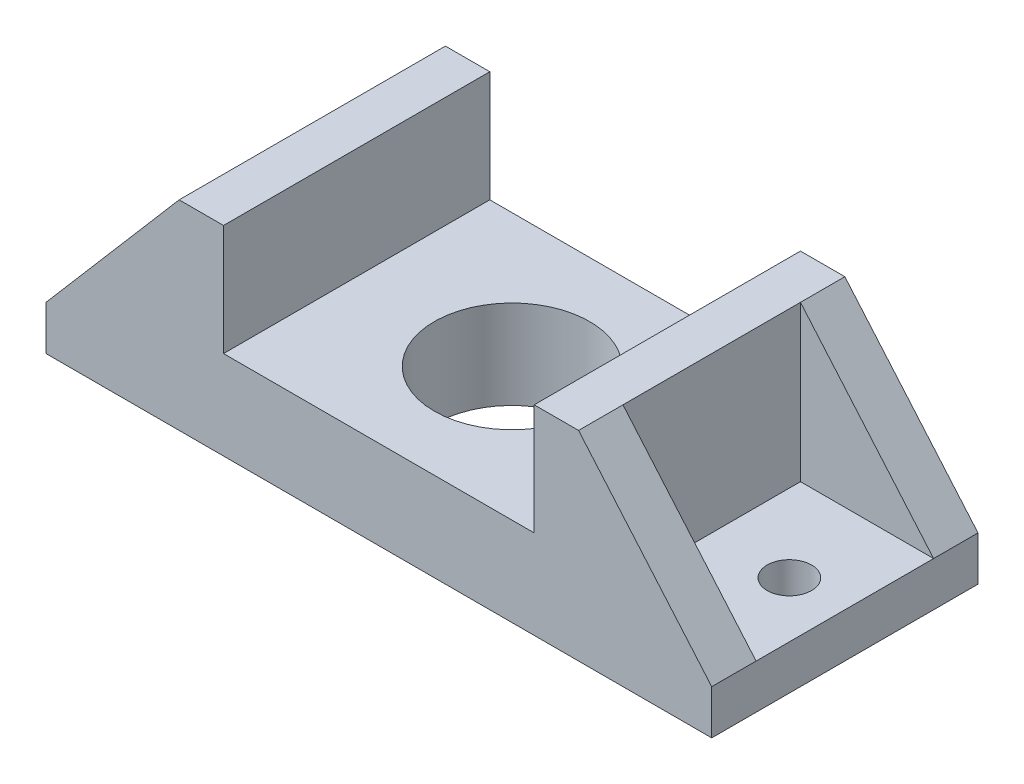
ISO-10303-21;
HEADER;
FILE_DESCRIPTION(('STEP AP214'),'2;1');
FILE_NAME('part.step','',(''),(''),'','','');
FILE_SCHEMA(('AUTOMOTIVE_DESIGN { 1 0 10303 214 1 1 1 1 }'));
ENDSEC;
DATA;
#1=APPLICATION_CONTEXT('core data for automotive mechanical design processes');
#2=APPLICATION_PROTOCOL_DEFINITION('international standard','automotive_design',2000,#1);
#3=PRODUCT_CONTEXT('',#1,'mechanical');
#4=PRODUCT('Part','Part','',(#3));
#5=PRODUCT_RELATED_PRODUCT_CATEGORY('part','',(#4));
#6=PRODUCT_DEFINITION_FORMATION('','',#4);
#7=PRODUCT_DEFINITION_CONTEXT('part definition',#1,'design');
#8=PRODUCT_DEFINITION('design','',#6,#7);
#9=PRODUCT_DEFINITION_SHAPE('','',#8);
#10=(LENGTH_UNIT() NAMED_UNIT(*) SI_UNIT(.MILLI.,.METRE.));
#11=(NAMED_UNIT(*) PLANE_ANGLE_UNIT() SI_UNIT($,.RADIAN.));
#12=(NAMED_UNIT(*) SI_UNIT($,.STERADIAN.) SOLID_ANGLE_UNIT());
#13=UNCERTAINTY_MEASURE_WITH_UNIT(LENGTH_MEASURE(1.E-05),#10,'distance_accuracy_value','');
#14=(GEOMETRIC_REPRESENTATION_CONTEXT(3) GLOBAL_UNCERTAINTY_ASSIGNED_CONTEXT((#13)) GLOBAL_UNIT_ASSIGNED_CONTEXT((#10,
#11,#12)) REPRESENTATION_CONTEXT('',''));
#15=CARTESIAN_POINT('',(0.,0.,0.));
#16=DIRECTION('',(0.,0.,1.));
#17=DIRECTION('',(1.,0.,0.));
#18=AXIS2_PLACEMENT_3D('',#15,#16,#17);
#19=CARTESIAN_POINT('',(0.,20.,0.));
#20=DIRECTION('',(0.,-1.,0.));
#21=DIRECTION('',(0.,0.,-1.));
#22=AXIS2_PLACEMENT_3D('',#19,#20,#21);
#23=PLANE('',#22);
#24=CARTESIAN_POINT('',(275.,20.,-60.));
#25=DIRECTION('',(0.,1.,0.));
#26=DIRECTION('',(0.,0.,-1.));
#27=AXIS2_PLACEMENT_3D('',#24,#25,#26);
#28=CIRCLE('',#27,10.);
#29=CARTESIAN_POINT('',(275.,20.,-70.));
#30=VERTEX_POINT('',#29);
#31=EDGE_CURVE('E373',#30,#30,#28,.T.);
#32=ORIENTED_EDGE('',*,*,#31,.F.);
#33=EDGE_LOOP('',(#32));
#34=FACE_BOUND('',#33,.T.);
#35=DIRECTION('',(-1.,0.,0.));
#36=VECTOR('',#35,1.);
#37=CARTESIAN_POINT('',(240.,20.,-20.));
#38=LINE('',#37,#36);
#39=CARTESIAN_POINT('',(300.,20.,-20.));
#40=VERTEX_POINT('',#39);
#41=CARTESIAN_POINT('',(240.,20.,-20.));
#42=VERTEX_POINT('',#41);
#43=EDGE_CURVE('E59',#40,#42,#38,.T.);
#44=ORIENTED_EDGE('',*,*,#43,.F.);
#45=DIRECTION('',(0.,0.,-1.));
#46=VECTOR('',#45,1.);
#47=CARTESIAN_POINT('',(300.,20.,0.));
#48=LINE('',#47,#46);
#49=CARTESIAN_POINT('',(300.,20.,-100.));
#50=VERTEX_POINT('',#49);
#51=EDGE_CURVE('E270',#40,#50,#48,.T.);
#52=ORIENTED_EDGE('',*,*,#51,.T.);
#53=DIRECTION('',(-1.,0.,0.));
#54=VECTOR('',#53,1.);
#55=CARTESIAN_POINT('',(240.,20.,-100.));
#56=LINE('',#55,#54);
#57=CARTESIAN_POINT('',(240.,20.,-100.));
#58=VERTEX_POINT('',#57);
#59=EDGE_CURVE('E184',#50,#58,#56,.T.);
#60=ORIENTED_EDGE('',*,*,#59,.T.);
#61=DIRECTION('',(0.,0.,1.));
#62=VECTOR('',#61,1.);
#63=CARTESIAN_POINT('',(240.,20.,-120.));
#64=LINE('',#63,#62);
#65=EDGE_CURVE('E235',#58,#42,#64,.T.);
#66=ORIENTED_EDGE('',*,*,#65,.T.);
#67=EDGE_LOOP('',(#44,#52,#60,#66));
#68=FACE_BOUND('',#67,.T.);
#69=ADVANCED_FACE('F36',(#34,#68),#23,.F.);
#70=CARTESIAN_POINT('',(240.,90.,-120.));
#71=DIRECTION('',(1.,0.,0.));
#72=DIRECTION('',(0.,0.,-1.));
#73=AXIS2_PLACEMENT_3D('',#70,#71,#72);
#74=PLANE('',#73);
#75=DIRECTION('',(0.,0.,1.));
#76=VECTOR('',#75,1.);
#77=CARTESIAN_POINT('',(240.,90.,-120.));
#78=LINE('',#77,#76);
#79=CARTESIAN_POINT('',(240.,90.,-100.));
#80=VERTEX_POINT('',#79);
#81=CARTESIAN_POINT('',(240.,90.,-20.));
#82=VERTEX_POINT('',#81);
#83=EDGE_CURVE('E240',#80,#82,#78,.T.);
#84=ORIENTED_EDGE('',*,*,#83,.T.);
#85=DIRECTION('',(0.,1.,0.));
#86=VECTOR('',#85,1.);
#87=CARTESIAN_POINT('',(240.,90.,-20.));
#88=LINE('',#87,#86);
#89=EDGE_CURVE('E52',#42,#82,#88,.T.);
#90=ORIENTED_EDGE('',*,*,#89,.F.);
#91=ORIENTED_EDGE('',*,*,#65,.F.);
#92=DIRECTION('',(0.,1.,0.));
#93=VECTOR('',#92,1.);
#94=CARTESIAN_POINT('',(240.,90.,-100.));
#95=LINE('',#94,#93);
#96=EDGE_CURVE('E186',#58,#80,#95,.T.);
#97=ORIENTED_EDGE('',*,*,#96,.T.);
#98=EDGE_LOOP('',(#84,#90,#91,#97));
#99=FACE_BOUND('',#98,.T.);
#100=ADVANCED_FACE('F348',(#99),#74,.T.);
#101=CARTESIAN_POINT('',(25.,20.,-60.));
#102=DIRECTION('',(0.,1.,0.));
#103=DIRECTION('',(0.,0.,1.));
#104=AXIS2_PLACEMENT_3D('',#101,#102,#103);
#105=CIRCLE('',#104,10.);
#106=CARTESIAN_POINT('',(25.,20.,-50.));
#107=VERTEX_POINT('',#106);
#108=EDGE_CURVE('E365',#107,#107,#105,.T.);
#109=ORIENTED_EDGE('',*,*,#108,.F.);
#110=EDGE_LOOP('',(#109));
#111=FACE_BOUND('',#110,.T.);
#112=DIRECTION('',(1.,0.,0.));
#113=VECTOR('',#112,1.);
#114=CARTESIAN_POINT('',(60.,20.,-100.));
#115=LINE('',#114,#113);
#116=CARTESIAN_POINT('',(0.,20.,-100.));
#117=VERTEX_POINT('',#116);
#118=CARTESIAN_POINT('',(60.,20.,-100.));
#119=VERTEX_POINT('',#118);
#120=EDGE_CURVE('E198',#117,#119,#115,.T.);
#121=ORIENTED_EDGE('',*,*,#120,.F.);
#122=DIRECTION('',(0.,0.,1.));
#123=VECTOR('',#122,1.);
#124=CARTESIAN_POINT('',(0.,20.,0.));
#125=LINE('',#124,#123);
#126=CARTESIAN_POINT('',(0.,20.,-20.));
#127=VERTEX_POINT('',#126);
#128=EDGE_CURVE('E271',#117,#127,#125,.T.);
#129=ORIENTED_EDGE('',*,*,#128,.T.);
#130=DIRECTION('',(1.,0.,0.));
#131=VECTOR('',#130,1.);
#132=CARTESIAN_POINT('',(60.,20.,-20.));
#133=LINE('',#132,#131);
#134=CARTESIAN_POINT('',(60.,20.,-20.));
#135=VERTEX_POINT('',#134);
#136=EDGE_CURVE('E207',#127,#135,#133,.T.);
#137=ORIENTED_EDGE('',*,*,#136,.T.);
#138=DIRECTION('',(0.,0.,1.));
#139=VECTOR('',#138,1.);
#140=CARTESIAN_POINT('',(60.,20.,-120.));
#141=LINE('',#140,#139);
#142=EDGE_CURVE('E248',#119,#135,#141,.T.);
#143=ORIENTED_EDGE('',*,*,#142,.F.);
#144=EDGE_LOOP('',(#121,#129,#137,#143));
#145=FACE_BOUND('',#144,.T.);
#146=ADVANCED_FACE('F309',(#111,#145),#23,.F.);
#147=CARTESIAN_POINT('',(60.,90.,-120.));
#148=DIRECTION('',(1.,0.,0.));
#149=DIRECTION('',(0.,0.,-1.));
#150=AXIS2_PLACEMENT_3D('',#147,#148,#149);
#151=PLANE('',#150);
#152=DIRECTION('',(0.,1.,0.));
#153=VECTOR('',#152,1.);
#154=CARTESIAN_POINT('',(60.,90.,-100.));
#155=LINE('',#154,#153);
#156=CARTESIAN_POINT('',(60.,90.,-100.));
#157=VERTEX_POINT('',#156);
#158=EDGE_CURVE('E202',#119,#157,#155,.T.);
#159=ORIENTED_EDGE('',*,*,#158,.F.);
#160=ORIENTED_EDGE('',*,*,#142,.T.);
#161=DIRECTION('',(0.,1.,0.));
#162=VECTOR('',#161,1.);
#163=CARTESIAN_POINT('',(60.,90.,-20.));
#164=LINE('',#163,#162);
#165=CARTESIAN_POINT('',(60.,90.,-20.));
#166=VERTEX_POINT('',#165);
#167=EDGE_CURVE('E210',#135,#166,#164,.T.);
#168=ORIENTED_EDGE('',*,*,#167,.T.);
#169=DIRECTION('',(0.,0.,1.));
#170=VECTOR('',#169,1.);
#171=CARTESIAN_POINT('',(60.,90.,-120.));
#172=LINE('',#171,#170);
#173=EDGE_CURVE('E253',#157,#166,#172,.T.);
#174=ORIENTED_EDGE('',*,*,#173,.F.);
#175=EDGE_LOOP('',(#159,#160,#168,#174));
#176=FACE_BOUND('',#175,.T.);
#177=ADVANCED_FACE('F316',(#176),#151,.F.);
#178=CARTESIAN_POINT('',(0.,20.,0.));
#179=DIRECTION('',(1.,0.,0.));
#180=DIRECTION('',(0.,0.,-1.));
#181=AXIS2_PLACEMENT_3D('',#178,#179,#180);
#182=PLANE('',#181);
#183=DIRECTION('',(0.,0.,1.));
#184=VECTOR('',#183,1.);
#185=CARTESIAN_POINT('',(0.,0.,0.));
#186=LINE('',#185,#184);
#187=CARTESIAN_POINT('',(0.,0.,-120.));
#188=VERTEX_POINT('',#187);
#189=CARTESIAN_POINT('',(0.,0.,0.));
#190=VERTEX_POINT('',#189);
#191=EDGE_CURVE('E266',#188,#190,#186,.T.);
#192=ORIENTED_EDGE('',*,*,#191,.T.);
#193=DIRECTION('',(0.,-1.,0.));
#194=VECTOR('',#193,1.);
#195=CARTESIAN_POINT('',(0.,20.,0.));
#196=LINE('',#195,#194);
#197=CARTESIAN_POINT('',(0.,20.,0.));
#198=VERTEX_POINT('',#197);
#199=EDGE_CURVE('E11',#198,#190,#196,.T.);
#200=ORIENTED_EDGE('',*,*,#199,.F.);
#201=DIRECTION('',(0.,0.,1.));
#202=VECTOR('',#201,1.);
#203=CARTESIAN_POINT('',(0.,20.,-20.));
#204=LINE('',#203,#202);
#205=EDGE_CURVE('E219',#127,#198,#204,.T.);
#206=ORIENTED_EDGE('',*,*,#205,.F.);
#207=ORIENTED_EDGE('',*,*,#128,.F.);
#208=CARTESIAN_POINT('',(0.,20.,-120.));
#209=VERTEX_POINT('',#208);
#210=EDGE_CURVE('E267',#209,#117,#125,.T.);
#211=ORIENTED_EDGE('',*,*,#210,.F.);
#212=DIRECTION('',(0.,-1.,0.));
#213=VECTOR('',#212,1.);
#214=CARTESIAN_POINT('',(0.,20.,-120.));
#215=LINE('',#214,#213);
#216=EDGE_CURVE('E274',#209,#188,#215,.T.);
#217=ORIENTED_EDGE('',*,*,#216,.T.);
#218=EDGE_LOOP('',(#192,#200,#206,#207,#211,#217));
#219=FACE_BOUND('',#218,.T.);
#220=ADVANCED_FACE('F38',(#219),#182,.F.);
#221=CARTESIAN_POINT('',(0.,20.,0.));
#222=DIRECTION('',(0.,0.,-1.));
#223=DIRECTION('',(-1.,0.,0.));
#224=AXIS2_PLACEMENT_3D('',#221,#222,#223);
#225=PLANE('',#224);
#226=DIRECTION('',(0.,-1.,0.));
#227=VECTOR('',#226,1.);
#228=CARTESIAN_POINT('',(300.,20.,0.));
#229=LINE('',#228,#227);
#230=CARTESIAN_POINT('',(300.,20.,0.));
#231=VERTEX_POINT('',#230);
#232=CARTESIAN_POINT('',(300.,0.,0.));
#233=VERTEX_POINT('',#232);
#234=EDGE_CURVE('E45',#231,#233,#229,.T.);
#235=ORIENTED_EDGE('',*,*,#234,.F.);
#236=DIRECTION('',(0.650791373455968,-0.759256602365297,0.));
#237=VECTOR('',#236,1.);
#238=CARTESIAN_POINT('',(300.,20.,0.));
#239=LINE('',#238,#237);
#240=CARTESIAN_POINT('',(240.,90.,0.));
#241=VERTEX_POINT('',#240);
#242=EDGE_CURVE('E169',#241,#231,#239,.T.);
#243=ORIENTED_EDGE('',*,*,#242,.F.);
#244=DIRECTION('',(-1.,0.,0.));
#245=VECTOR('',#244,1.);
#246=CARTESIAN_POINT('',(240.,90.,0.));
#247=LINE('',#246,#245);
#248=CARTESIAN_POINT('',(220.,90.,0.));
#249=VERTEX_POINT('',#248);
#250=EDGE_CURVE('E152',#241,#249,#247,.T.);
#251=ORIENTED_EDGE('',*,*,#250,.T.);
#252=DIRECTION('',(0.,-1.,0.));
#253=VECTOR('',#252,1.);
#254=CARTESIAN_POINT('',(220.,90.,0.));
#255=LINE('',#254,#253);
#256=CARTESIAN_POINT('',(220.,40.,0.));
#257=VERTEX_POINT('',#256);
#258=EDGE_CURVE('E162',#249,#257,#255,.T.);
#259=ORIENTED_EDGE('',*,*,#258,.T.);
#260=DIRECTION('',(1.,0.,0.));
#261=VECTOR('',#260,1.);
#262=CARTESIAN_POINT('',(80.,40.,0.));
#263=LINE('',#262,#261);
#264=CARTESIAN_POINT('',(80.,40.,0.));
#265=VERTEX_POINT('',#264);
#266=EDGE_CURVE('E226',#265,#257,#263,.T.);
#267=ORIENTED_EDGE('',*,*,#266,.F.);
#268=DIRECTION('',(0.,-1.,0.));
#269=VECTOR('',#268,1.);
#270=CARTESIAN_POINT('',(80.,90.,0.));
#271=LINE('',#270,#269);
#272=CARTESIAN_POINT('',(80.,90.,0.));
#273=VERTEX_POINT('',#272);
#274=EDGE_CURVE('E264',#273,#265,#271,.T.);
#275=ORIENTED_EDGE('',*,*,#274,.F.);
#276=DIRECTION('',(1.,0.,0.));
#277=VECTOR('',#276,1.);
#278=CARTESIAN_POINT('',(60.,90.,0.));
#279=LINE('',#278,#277);
#280=CARTESIAN_POINT('',(60.,90.,0.));
#281=VERTEX_POINT('',#280);
#282=EDGE_CURVE('E252',#281,#273,#279,.T.);
#283=ORIENTED_EDGE('',*,*,#282,.F.);
#284=DIRECTION('',(-0.650791373455968,-0.759256602365297,0.));
#285=VECTOR('',#284,1.);
#286=CARTESIAN_POINT('',(0.,20.,0.));
#287=LINE('',#286,#285);
#288=EDGE_CURVE('E205',#281,#198,#287,.T.);
#289=ORIENTED_EDGE('',*,*,#288,.T.);
#290=ORIENTED_EDGE('',*,*,#199,.T.);
#291=DIRECTION('',(1.,0.,0.));
#292=VECTOR('',#291,1.);
#293=CARTESIAN_POINT('',(0.,0.,0.));
#294=LINE('',#293,#292);
#295=EDGE_CURVE('E277',#190,#233,#294,.T.);
#296=ORIENTED_EDGE('',*,*,#295,.T.);
#297=EDGE_LOOP('',(#235,#243,#251,#259,#267,#275,#283,#289,#290,#296));
#298=FACE_BOUND('',#297,.T.);
#299=ADVANCED_FACE('F174',(#298),#225,.F.);
#300=CARTESIAN_POINT('',(300.,20.,0.));
#301=DIRECTION('',(-1.,0.,0.));
#302=DIRECTION('',(0.,0.,1.));
#303=AXIS2_PLACEMENT_3D('',#300,#301,#302);
#304=PLANE('',#303);
#305=DIRECTION('',(0.,0.,-1.));
#306=VECTOR('',#305,1.);
#307=CARTESIAN_POINT('',(300.,0.,0.));
#308=LINE('',#307,#306);
#309=CARTESIAN_POINT('',(300.,0.,-120.));
#310=VERTEX_POINT('',#309);
#311=EDGE_CURVE('E279',#233,#310,#308,.T.);
#312=ORIENTED_EDGE('',*,*,#311,.T.);
#313=DIRECTION('',(0.,-1.,0.));
#314=VECTOR('',#313,1.);
#315=CARTESIAN_POINT('',(300.,20.,-120.));
#316=LINE('',#315,#314);
#317=CARTESIAN_POINT('',(300.,20.,-120.));
#318=VERTEX_POINT('',#317);
#319=EDGE_CURVE('E285',#318,#310,#316,.T.);
#320=ORIENTED_EDGE('',*,*,#319,.F.);
#321=DIRECTION('',(0.,0.,-1.));
#322=VECTOR('',#321,1.);
#323=CARTESIAN_POINT('',(300.,20.,-100.));
#324=LINE('',#323,#322);
#325=EDGE_CURVE('E192',#50,#318,#324,.T.);
#326=ORIENTED_EDGE('',*,*,#325,.F.);
#327=ORIENTED_EDGE('',*,*,#51,.F.);
#328=EDGE_CURVE('E272',#231,#40,#48,.T.);
#329=ORIENTED_EDGE('',*,*,#328,.F.);
#330=ORIENTED_EDGE('',*,*,#234,.T.);
#331=EDGE_LOOP('',(#312,#320,#326,#327,#329,#330));
#332=FACE_BOUND('',#331,.T.);
#333=ADVANCED_FACE('F290',(#332),#304,.F.);
#334=CARTESIAN_POINT('',(0.,20.,-120.));
#335=DIRECTION('',(0.,0.,1.));
#336=DIRECTION('',(1.,0.,0.));
#337=AXIS2_PLACEMENT_3D('',#334,#335,#336);
#338=PLANE('',#337);
#339=ORIENTED_EDGE('',*,*,#216,.F.);
#340=DIRECTION('',(-0.650791373455968,-0.759256602365297,0.));
#341=VECTOR('',#340,1.);
#342=CARTESIAN_POINT('',(0.,20.,-120.));
#343=LINE('',#342,#341);
#344=CARTESIAN_POINT('',(60.,90.,-120.));
#345=VERTEX_POINT('',#344);
#346=EDGE_CURVE('E197',#345,#209,#343,.T.);
#347=ORIENTED_EDGE('',*,*,#346,.F.);
#348=DIRECTION('',(-1.,0.,0.));
#349=VECTOR('',#348,1.);
#350=CARTESIAN_POINT('',(60.,90.,-120.));
#351=LINE('',#350,#349);
#352=CARTESIAN_POINT('',(80.,90.,-120.));
#353=VERTEX_POINT('',#352);
#354=EDGE_CURVE('E257',#353,#345,#351,.T.);
#355=ORIENTED_EDGE('',*,*,#354,.F.);
#356=DIRECTION('',(0.,-1.,0.));
#357=VECTOR('',#356,1.);
#358=CARTESIAN_POINT('',(80.,90.,-120.));
#359=LINE('',#358,#357);
#360=CARTESIAN_POINT('',(80.,40.,-120.));
#361=VERTEX_POINT('',#360);
#362=EDGE_CURVE('E260',#353,#361,#359,.T.);
#363=ORIENTED_EDGE('',*,*,#362,.T.);
#364=DIRECTION('',(-1.,0.,0.));
#365=VECTOR('',#364,1.);
#366=CARTESIAN_POINT('',(80.,40.,-120.));
#367=LINE('',#366,#365);
#368=CARTESIAN_POINT('',(220.,40.,-120.));
#369=VERTEX_POINT('',#368);
#370=EDGE_CURVE('E232',#369,#361,#367,.T.);
#371=ORIENTED_EDGE('',*,*,#370,.F.);
#372=DIRECTION('',(0.,-1.,0.));
#373=VECTOR('',#372,1.);
#374=CARTESIAN_POINT('',(220.,90.,-120.));
#375=LINE('',#374,#373);
#376=CARTESIAN_POINT('',(220.,90.,-120.));
#377=VERTEX_POINT('',#376);
#378=EDGE_CURVE('E246',#377,#369,#375,.T.);
#379=ORIENTED_EDGE('',*,*,#378,.F.);
#380=DIRECTION('',(1.,0.,0.));
#381=VECTOR('',#380,1.);
#382=CARTESIAN_POINT('',(240.,90.,-120.));
#383=LINE('',#382,#381);
#384=CARTESIAN_POINT('',(240.,90.,-120.));
#385=VERTEX_POINT('',#384);
#386=EDGE_CURVE('E239',#377,#385,#383,.T.);
#387=ORIENTED_EDGE('',*,*,#386,.T.);
#388=DIRECTION('',(0.650791373455968,-0.759256602365297,0.));
#389=VECTOR('',#388,1.);
#390=CARTESIAN_POINT('',(300.,20.,-120.));
#391=LINE('',#390,#389);
#392=EDGE_CURVE('E172',#385,#318,#391,.T.);
#393=ORIENTED_EDGE('',*,*,#392,.T.);
#394=ORIENTED_EDGE('',*,*,#319,.T.);
#395=DIRECTION('',(-1.,0.,0.));
#396=VECTOR('',#395,1.);
#397=CARTESIAN_POINT('',(0.,0.,-120.));
#398=LINE('',#397,#396);
#399=EDGE_CURVE('E281',#310,#188,#398,.T.);
#400=ORIENTED_EDGE('',*,*,#399,.T.);
#401=EDGE_LOOP('',(#339,#347,#355,#363,#371,#379,#387,#393,#394,#400));
#402=FACE_BOUND('',#401,.T.);
#403=ADVANCED_FACE('F297',(#402),#338,.F.);
#404=CARTESIAN_POINT('',(0.,0.,0.));
#405=DIRECTION('',(0.,-1.,0.));
#406=DIRECTION('',(0.,0.,-1.));
#407=AXIS2_PLACEMENT_3D('',#404,#405,#406);
#408=PLANE('',#407);
#409=CARTESIAN_POINT('',(25.,0.,-60.));
#410=DIRECTION('',(0.,1.,0.));
#411=DIRECTION('',(0.,0.,1.));
#412=AXIS2_PLACEMENT_3D('',#409,#410,#411);
#413=CIRCLE('',#412,10.);
#414=CARTESIAN_POINT('',(25.,0.,-50.));
#415=VERTEX_POINT('',#414);
#416=EDGE_CURVE('E367',#415,#415,#413,.T.);
#417=ORIENTED_EDGE('',*,*,#416,.T.);
#418=EDGE_LOOP('',(#417));
#419=FACE_BOUND('',#418,.T.);
#420=CARTESIAN_POINT('',(275.,0.,-60.));
#421=DIRECTION('',(0.,1.,0.));
#422=DIRECTION('',(0.,0.,-1.));
#423=AXIS2_PLACEMENT_3D('',#420,#421,#422);
#424=CIRCLE('',#423,10.);
#425=CARTESIAN_POINT('',(275.,0.,-70.));
#426=VERTEX_POINT('',#425);
#427=EDGE_CURVE('E368',#426,#426,#424,.T.);
#428=ORIENTED_EDGE('',*,*,#427,.T.);
#429=EDGE_LOOP('',(#428));
#430=FACE_BOUND('',#429,.T.);
#431=CARTESIAN_POINT('',(150.,0.,-60.));
#432=DIRECTION('',(0.,1.,0.));
#433=DIRECTION('',(0.,0.,1.));
#434=AXIS2_PLACEMENT_3D('',#431,#432,#433);
#435=CIRCLE('',#434,35.);
#436=CARTESIAN_POINT('',(150.,0.,-25.));
#437=VERTEX_POINT('',#436);
#438=EDGE_CURVE('E180',#437,#437,#435,.T.);
#439=ORIENTED_EDGE('',*,*,#438,.T.);
#440=EDGE_LOOP('',(#439));
#441=FACE_BOUND('',#440,.T.);
#442=ORIENTED_EDGE('',*,*,#191,.F.);
#443=ORIENTED_EDGE('',*,*,#399,.F.);
#444=ORIENTED_EDGE('',*,*,#311,.F.);
#445=ORIENTED_EDGE('',*,*,#295,.F.);
#446=EDGE_LOOP('',(#442,#443,#444,#445));
#447=FACE_BOUND('',#446,.T.);
#448=ADVANCED_FACE('F294',(#419,#430,#441,#447),#408,.T.);
#449=CARTESIAN_POINT('',(80.,90.,-120.));
#450=DIRECTION('',(-1.,0.,0.));
#451=DIRECTION('',(0.,0.,1.));
#452=AXIS2_PLACEMENT_3D('',#449,#450,#451);
#453=PLANE('',#452);
#454=ORIENTED_EDGE('',*,*,#274,.T.);
#455=DIRECTION('',(0.,0.,1.));
#456=VECTOR('',#455,1.);
#457=CARTESIAN_POINT('',(80.,40.,-120.));
#458=LINE('',#457,#456);
#459=EDGE_CURVE('E221',#361,#265,#458,.T.);
#460=ORIENTED_EDGE('',*,*,#459,.F.);
#461=ORIENTED_EDGE('',*,*,#362,.F.);
#462=DIRECTION('',(0.,0.,-1.));
#463=VECTOR('',#462,1.);
#464=CARTESIAN_POINT('',(80.,90.,-120.));
#465=LINE('',#464,#463);
#466=EDGE_CURVE('E255',#273,#353,#465,.T.);
#467=ORIENTED_EDGE('',*,*,#466,.F.);
#468=EDGE_LOOP('',(#454,#460,#461,#467));
#469=FACE_BOUND('',#468,.T.);
#470=ADVANCED_FACE('F333',(#469),#453,.F.);
#471=CARTESIAN_POINT('',(0.,90.,0.));
#472=DIRECTION('',(0.,1.,0.));
#473=DIRECTION('',(0.,0.,1.));
#474=AXIS2_PLACEMENT_3D('',#471,#472,#473);
#475=PLANE('',#474);
#476=EDGE_CURVE('E249',#345,#157,#172,.T.);
#477=ORIENTED_EDGE('',*,*,#476,.T.);
#478=ORIENTED_EDGE('',*,*,#173,.T.);
#479=DIRECTION('',(0.,0.,1.));
#480=VECTOR('',#479,1.);
#481=CARTESIAN_POINT('',(60.,90.,-20.));
#482=LINE('',#481,#480);
#483=EDGE_CURVE('E216',#166,#281,#482,.T.);
#484=ORIENTED_EDGE('',*,*,#483,.T.);
#485=ORIENTED_EDGE('',*,*,#282,.T.);
#486=ORIENTED_EDGE('',*,*,#466,.T.);
#487=ORIENTED_EDGE('',*,*,#354,.T.);
#488=EDGE_LOOP('',(#477,#478,#484,#485,#486,#487));
#489=FACE_BOUND('',#488,.T.);
#490=ADVANCED_FACE('F320',(#489),#475,.T.);
#491=CARTESIAN_POINT('',(220.,90.,-120.));
#492=DIRECTION('',(-1.,0.,0.));
#493=DIRECTION('',(0.,0.,1.));
#494=AXIS2_PLACEMENT_3D('',#491,#492,#493);
#495=PLANE('',#494);
#496=DIRECTION('',(0.,0.,-1.));
#497=VECTOR('',#496,1.);
#498=CARTESIAN_POINT('',(220.,40.,-120.));
#499=LINE('',#498,#497);
#500=EDGE_CURVE('E229',#257,#369,#499,.T.);
#501=ORIENTED_EDGE('',*,*,#500,.F.);
#502=ORIENTED_EDGE('',*,*,#258,.F.);
#503=DIRECTION('',(0.,0.,-1.));
#504=VECTOR('',#503,1.);
#505=CARTESIAN_POINT('',(220.,90.,-120.));
#506=LINE('',#505,#504);
#507=EDGE_CURVE('E158',#249,#377,#506,.T.);
#508=ORIENTED_EDGE('',*,*,#507,.T.);
#509=ORIENTED_EDGE('',*,*,#378,.T.);
#510=EDGE_LOOP('',(#501,#502,#508,#509));
#511=FACE_BOUND('',#510,.T.);
#512=ADVANCED_FACE('F330',(#511),#495,.T.);
#513=CARTESIAN_POINT('',(300.,90.,0.));
#514=DIRECTION('',(0.,1.,0.));
#515=DIRECTION('',(0.,0.,1.));
#516=AXIS2_PLACEMENT_3D('',#513,#514,#515);
#517=PLANE('',#516);
#518=EDGE_CURVE('E236',#385,#80,#78,.T.);
#519=ORIENTED_EDGE('',*,*,#518,.F.);
#520=ORIENTED_EDGE('',*,*,#386,.F.);
#521=ORIENTED_EDGE('',*,*,#507,.F.);
#522=ORIENTED_EDGE('',*,*,#250,.F.);
#523=DIRECTION('',(0.,0.,1.));
#524=VECTOR('',#523,1.);
#525=CARTESIAN_POINT('',(240.,90.,-20.));
#526=LINE('',#525,#524);
#527=EDGE_CURVE('E155',#82,#241,#526,.T.);
#528=ORIENTED_EDGE('',*,*,#527,.F.);
#529=ORIENTED_EDGE('',*,*,#83,.F.);
#530=EDGE_LOOP('',(#519,#520,#521,#522,#528,#529));
#531=FACE_BOUND('',#530,.T.);
#532=ADVANCED_FACE('F154',(#531),#517,.T.);
#533=CARTESIAN_POINT('',(0.,40.,0.));
#534=DIRECTION('',(0.,1.,0.));
#535=DIRECTION('',(0.,0.,1.));
#536=AXIS2_PLACEMENT_3D('',#533,#534,#535);
#537=PLANE('',#536);
#538=CARTESIAN_POINT('',(150.,40.,-60.));
#539=DIRECTION('',(0.,1.,0.));
#540=DIRECTION('',(0.,0.,1.));
#541=AXIS2_PLACEMENT_3D('',#538,#539,#540);
#542=CIRCLE('',#541,35.);
#543=CARTESIAN_POINT('',(150.,40.,-25.));
#544=VERTEX_POINT('',#543);
#545=EDGE_CURVE('E40',#544,#544,#542,.T.);
#546=ORIENTED_EDGE('',*,*,#545,.F.);
#547=EDGE_LOOP('',(#546));
#548=FACE_BOUND('',#547,.T.);
#549=ORIENTED_EDGE('',*,*,#459,.T.);
#550=ORIENTED_EDGE('',*,*,#266,.T.);
#551=ORIENTED_EDGE('',*,*,#500,.T.);
#552=ORIENTED_EDGE('',*,*,#370,.T.);
#553=EDGE_LOOP('',(#549,#550,#551,#552));
#554=FACE_BOUND('',#553,.T.);
#555=ADVANCED_FACE('F327',(#548,#554),#537,.T.);
#556=CARTESIAN_POINT('',(0.,20.,-20.));
#557=DIRECTION('',(-0.759256602365297,0.650791373455968,0.));
#558=DIRECTION('',(-0.650791373455968,-0.759256602365297,0.));
#559=AXIS2_PLACEMENT_3D('',#556,#557,#558);
#560=PLANE('',#559);
#561=ORIENTED_EDGE('',*,*,#288,.F.);
#562=ORIENTED_EDGE('',*,*,#483,.F.);
#563=DIRECTION('',(-0.650791373455968,-0.759256602365297,0.));
#564=VECTOR('',#563,1.);
#565=CARTESIAN_POINT('',(0.,20.,-20.));
#566=LINE('',#565,#564);
#567=EDGE_CURVE('E213',#166,#127,#566,.T.);
#568=ORIENTED_EDGE('',*,*,#567,.T.);
#569=ORIENTED_EDGE('',*,*,#205,.T.);
#570=EDGE_LOOP('',(#561,#562,#568,#569));
#571=FACE_BOUND('',#570,.T.);
#572=ADVANCED_FACE('F336',(#571),#560,.T.);
#573=CARTESIAN_POINT('',(0.,0.,-20.));
#574=DIRECTION('',(0.,0.,1.));
#575=DIRECTION('',(1.,0.,0.));
#576=AXIS2_PLACEMENT_3D('',#573,#574,#575);
#577=PLANE('',#576);
#578=ORIENTED_EDGE('',*,*,#136,.F.);
#579=ORIENTED_EDGE('',*,*,#567,.F.);
#580=ORIENTED_EDGE('',*,*,#167,.F.);
#581=EDGE_LOOP('',(#578,#579,#580));
#582=FACE_BOUND('',#581,.T.);
#583=ADVANCED_FACE('F338',(#582),#577,.F.);
#584=CARTESIAN_POINT('',(0.,20.,-100.));
#585=DIRECTION('',(0.759256602365297,-0.650791373455968,0.));
#586=DIRECTION('',(0.650791373455968,0.759256602365297,0.));
#587=AXIS2_PLACEMENT_3D('',#584,#585,#586);
#588=PLANE('',#587);
#589=ORIENTED_EDGE('',*,*,#346,.T.);
#590=ORIENTED_EDGE('',*,*,#210,.T.);
#591=DIRECTION('',(-0.650791373455968,-0.759256602365297,0.));
#592=VECTOR('',#591,1.);
#593=CARTESIAN_POINT('',(0.,20.,-100.));
#594=LINE('',#593,#592);
#595=EDGE_CURVE('E200',#157,#117,#594,.T.);
#596=ORIENTED_EDGE('',*,*,#595,.F.);
#597=ORIENTED_EDGE('',*,*,#476,.F.);
#598=EDGE_LOOP('',(#589,#590,#596,#597));
#599=FACE_BOUND('',#598,.T.);
#600=ADVANCED_FACE('F306',(#599),#588,.F.);
#601=CARTESIAN_POINT('',(0.,0.,-100.));
#602=DIRECTION('',(0.,0.,-1.));
#603=DIRECTION('',(1.,0.,0.));
#604=AXIS2_PLACEMENT_3D('',#601,#602,#603);
#605=PLANE('',#604);
#606=ORIENTED_EDGE('',*,*,#120,.T.);
#607=ORIENTED_EDGE('',*,*,#158,.T.);
#608=ORIENTED_EDGE('',*,*,#595,.T.);
#609=EDGE_LOOP('',(#606,#607,#608));
#610=FACE_BOUND('',#609,.T.);
#611=ADVANCED_FACE('F313',(#610),#605,.F.);
#612=CARTESIAN_POINT('',(300.,20.,-100.));
#613=DIRECTION('',(0.759256602365297,0.650791373455968,0.));
#614=DIRECTION('',(-0.650791373455968,0.759256602365297,0.));
#615=AXIS2_PLACEMENT_3D('',#612,#613,#614);
#616=PLANE('',#615);
#617=ORIENTED_EDGE('',*,*,#392,.F.);
#618=ORIENTED_EDGE('',*,*,#518,.T.);
#619=DIRECTION('',(0.650791373455968,-0.759256602365297,0.));
#620=VECTOR('',#619,1.);
#621=CARTESIAN_POINT('',(300.,20.,-100.));
#622=LINE('',#621,#620);
#623=EDGE_CURVE('E189',#80,#50,#622,.T.);
#624=ORIENTED_EDGE('',*,*,#623,.T.);
#625=ORIENTED_EDGE('',*,*,#325,.T.);
#626=EDGE_LOOP('',(#617,#618,#624,#625));
#627=FACE_BOUND('',#626,.T.);
#628=ADVANCED_FACE('F397',(#627),#616,.T.);
#629=CARTESIAN_POINT('',(300.,0.,-100.));
#630=DIRECTION('',(0.,0.,-1.));
#631=DIRECTION('',(-1.,0.,0.));
#632=AXIS2_PLACEMENT_3D('',#629,#630,#631);
#633=PLANE('',#632);
#634=ORIENTED_EDGE('',*,*,#59,.F.);
#635=ORIENTED_EDGE('',*,*,#623,.F.);
#636=ORIENTED_EDGE('',*,*,#96,.F.);
#637=EDGE_LOOP('',(#634,#635,#636));
#638=FACE_BOUND('',#637,.T.);
#639=ADVANCED_FACE('F391',(#638),#633,.F.);
#640=CARTESIAN_POINT('',(300.,20.,-20.));
#641=DIRECTION('',(-0.759256602365297,-0.650791373455968,0.));
#642=DIRECTION('',(0.650791373455968,-0.759256602365297,0.));
#643=AXIS2_PLACEMENT_3D('',#640,#641,#642);
#644=PLANE('',#643);
#645=ORIENTED_EDGE('',*,*,#242,.T.);
#646=ORIENTED_EDGE('',*,*,#328,.T.);
#647=DIRECTION('',(0.650791373455968,-0.759256602365297,0.));
#648=VECTOR('',#647,1.);
#649=CARTESIAN_POINT('',(300.,20.,-20.));
#650=LINE('',#649,#648);
#651=EDGE_CURVE('E171',#82,#40,#650,.T.);
#652=ORIENTED_EDGE('',*,*,#651,.F.);
#653=ORIENTED_EDGE('',*,*,#527,.T.);
#654=EDGE_LOOP('',(#645,#646,#652,#653));
#655=FACE_BOUND('',#654,.T.);
#656=ADVANCED_FACE('F167',(#655),#644,.F.);
#657=CARTESIAN_POINT('',(300.,0.,-20.));
#658=DIRECTION('',(0.,0.,1.));
#659=DIRECTION('',(-1.,0.,0.));
#660=AXIS2_PLACEMENT_3D('',#657,#658,#659);
#661=PLANE('',#660);
#662=ORIENTED_EDGE('',*,*,#43,.T.);
#663=ORIENTED_EDGE('',*,*,#89,.T.);
#664=ORIENTED_EDGE('',*,*,#651,.T.);
#665=EDGE_LOOP('',(#662,#663,#664));
#666=FACE_BOUND('',#665,.T.);
#667=ADVANCED_FACE('F380',(#666),#661,.F.);
#668=CARTESIAN_POINT('',(150.,0.,-60.));
#669=DIRECTION('',(0.,1.,0.));
#670=DIRECTION('',(0.,0.,1.));
#671=AXIS2_PLACEMENT_3D('',#668,#669,#670);
#672=CYLINDRICAL_SURFACE('',#671,35.);
#673=ORIENTED_EDGE('',*,*,#545,.T.);
#674=EDGE_LOOP('',(#673));
#675=FACE_BOUND('',#674,.T.);
#676=ORIENTED_EDGE('',*,*,#438,.F.);
#677=EDGE_LOOP('',(#676));
#678=FACE_BOUND('',#677,.T.);
#679=ADVANCED_FACE('F382',(#675,#678),#672,.F.);
#680=CARTESIAN_POINT('',(275.,0.,-60.));
#681=DIRECTION('',(0.,1.,0.));
#682=DIRECTION('',(0.,0.,1.));
#683=AXIS2_PLACEMENT_3D('',#680,#681,#682);
#684=CYLINDRICAL_SURFACE('',#683,10.);
#685=ORIENTED_EDGE('',*,*,#427,.F.);
#686=EDGE_LOOP('',(#685));
#687=FACE_BOUND('',#686,.T.);
#688=ORIENTED_EDGE('',*,*,#31,.T.);
#689=EDGE_LOOP('',(#688));
#690=FACE_BOUND('',#689,.T.);
#691=ADVANCED_FACE('F388',(#687,#690),#684,.F.);
#692=CARTESIAN_POINT('',(25.,0.,-60.));
#693=DIRECTION('',(0.,1.,0.));
#694=DIRECTION('',(0.,0.,1.));
#695=AXIS2_PLACEMENT_3D('',#692,#693,#694);
#696=CYLINDRICAL_SURFACE('',#695,10.);
#697=ORIENTED_EDGE('',*,*,#416,.F.);
#698=EDGE_LOOP('',(#697));
#699=FACE_BOUND('',#698,.T.);
#700=ORIENTED_EDGE('',*,*,#108,.T.);
#701=EDGE_LOOP('',(#700));
#702=FACE_BOUND('',#701,.T.);
#703=ADVANCED_FACE('F476',(#699,#702),#696,.F.);
#704=CLOSED_SHELL('',(#69,#100,#146,#177,#220,#299,#333,#403,#448,#470,#490,#512,#532,#555,#572,
#583,#600,#611,#628,#639,#656,#667,#679,#691,#703));
#705=MANIFOLD_SOLID_BREP('B2',#704);
#706=ADVANCED_BREP_SHAPE_REPRESENTATION('',(#18,#705),#14);
#707=SHAPE_DEFINITION_REPRESENTATION(#9,#706);
ENDSEC;
END-ISO-10303-21;
